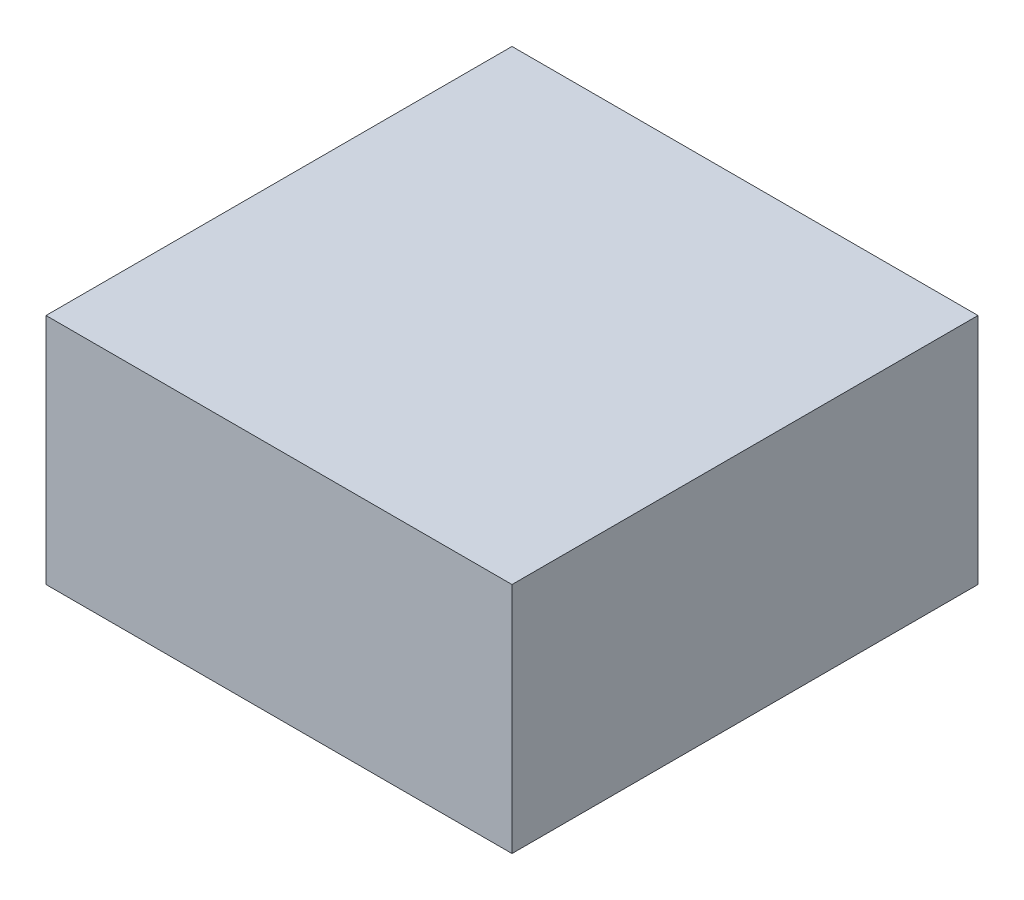
ISO-10303-21;
HEADER;
FILE_DESCRIPTION(('STEP AP214'),'2;1');
FILE_NAME('part.step','',(''),(''),'','','');
FILE_SCHEMA(('AUTOMOTIVE_DESIGN { 1 0 10303 214 1 1 1 1 }'));
ENDSEC;
DATA;
#1=APPLICATION_CONTEXT('core data for automotive mechanical design processes');
#2=APPLICATION_PROTOCOL_DEFINITION('international standard','automotive_design',2000,#1);
#3=PRODUCT_CONTEXT('',#1,'mechanical');
#4=PRODUCT('Part','Part','',(#3));
#5=PRODUCT_RELATED_PRODUCT_CATEGORY('part','',(#4));
#6=PRODUCT_DEFINITION_FORMATION('','',#4);
#7=PRODUCT_DEFINITION_CONTEXT('part definition',#1,'design');
#8=PRODUCT_DEFINITION('design','',#6,#7);
#9=PRODUCT_DEFINITION_SHAPE('','',#8);
#10=(LENGTH_UNIT() NAMED_UNIT(*) SI_UNIT(.MILLI.,.METRE.));
#11=(NAMED_UNIT(*) PLANE_ANGLE_UNIT() SI_UNIT($,.RADIAN.));
#12=(NAMED_UNIT(*) SI_UNIT($,.STERADIAN.) SOLID_ANGLE_UNIT());
#13=UNCERTAINTY_MEASURE_WITH_UNIT(LENGTH_MEASURE(1.E-05),#10,'distance_accuracy_value','');
#14=(GEOMETRIC_REPRESENTATION_CONTEXT(3) GLOBAL_UNCERTAINTY_ASSIGNED_CONTEXT((#13)) GLOBAL_UNIT_ASSIGNED_CONTEXT((#10,
#11,#12)) REPRESENTATION_CONTEXT('',''));
#15=CARTESIAN_POINT('',(0.,0.,0.));
#16=DIRECTION('',(0.,0.,1.));
#17=DIRECTION('',(1.,0.,0.));
#18=AXIS2_PLACEMENT_3D('',#15,#16,#17);
#19=CARTESIAN_POINT('',(-1.32978682457797,-4.7,12.0470966404881));
#20=CARTESIAN_POINT('',(-1.56949938233388,-4.7,12.2405123536894));
#21=CARTESIAN_POINT('',(-2.08614424851907,-4.7,12.5391697720833));
#22=CARTESIAN_POINT('',(-1.58643209411403,-4.7,13.1168891119311));
#23=CARTESIAN_POINT('',(-0.99479110722871,-4.7,13.4609601521511));
#24=CARTESIAN_POINT('',(-0.122057096544853,-4.7,13.5063472457396));
#25=CARTESIAN_POINT('',(0.780549472015395,-4.7,13.1044677868928));
#26=CARTESIAN_POINT('',(2.65290980881673,-4.7,13.5718372621998));
#27=CARTESIAN_POINT('',(1.37260667116618,-4.7,11.7465735610998));
#28=CARTESIAN_POINT('',(0.251281573482777,-4.7,11.3225744749199));
#29=CARTESIAN_POINT('',(-0.824147776626976,-4.7,11.5489578340658));
#30=CARTESIAN_POINT('',(-1.19634203116918,-4.7,11.9394246848268));
#31=CARTESIAN_POINT('',(-1.32978682457797,-4.7,12.0470966404881));
#32=B_SPLINE_CURVE_WITH_KNOTS('',3,(#19,#20,#21,#22,#23,#24,#25,#26,#27,#28,#29,#30,#31),
.UNSPECIFIED.,.T.,.F.,(4,1,1,1,1,1,1,1,1,1,4),(0.,0.0890314863366276,0.133435272323839,
0.204833870138696,0.315562123210451,0.38661889368764,0.538438655581061,0.696738525235763,
0.817182112999442,0.95043735542146,1.),.UNSPECIFIED.);
#33=DIRECTION('',(0.,-1.,0.));
#34=VECTOR('',#33,1.);
#35=SURFACE_OF_LINEAR_EXTRUSION('',#32,#34);
#36=CARTESIAN_POINT('',(-1.32978682457797,-4.7,12.0470966404881));
#37=VERTEX_POINT('',#36);
#38=EDGE_CURVE('E11',#37,#37,#32,.T.);
#39=ORIENTED_EDGE('',*,*,#38,.F.);
#40=EDGE_LOOP('',(#39));
#41=FACE_BOUND('',#40,.T.);
#42=CARTESIAN_POINT('',(-1.32978682457797,-5.,12.0470966404881));
#43=CARTESIAN_POINT('',(-1.56949938233388,-5.,12.2405123536894));
#44=CARTESIAN_POINT('',(-2.08614424851907,-5.,12.5391697720833));
#45=CARTESIAN_POINT('',(-1.58643209411403,-5.,13.1168891119311));
#46=CARTESIAN_POINT('',(-0.99479110722871,-5.,13.4609601521511));
#47=CARTESIAN_POINT('',(-0.122057096544853,-5.,13.5063472457396));
#48=CARTESIAN_POINT('',(0.780549472015395,-5.,13.1044677868928));
#49=CARTESIAN_POINT('',(2.65290980881673,-5.,13.5718372621998));
#50=CARTESIAN_POINT('',(1.37260667116618,-5.,11.7465735610998));
#51=CARTESIAN_POINT('',(0.251281573482777,-5.,11.3225744749199));
#52=CARTESIAN_POINT('',(-0.824147776626976,-5.,11.5489578340658));
#53=CARTESIAN_POINT('',(-1.19634203116918,-5.,11.9394246848268));
#54=CARTESIAN_POINT('',(-1.32978682457797,-5.,12.0470966404881));
#55=B_SPLINE_CURVE_WITH_KNOTS('',3,(#42,#43,#44,#45,#46,#47,#48,#49,#50,#51,#52,#53,#54),
.UNSPECIFIED.,.T.,.F.,(4,1,1,1,1,1,1,1,1,1,4),(0.,0.0890314863366276,0.133435272323839,
0.204833870138696,0.315562123210451,0.38661889368764,0.538438655581061,0.696738525235763,
0.817182112999442,0.95043735542146,1.),.UNSPECIFIED.);
#56=CARTESIAN_POINT('',(-1.32978682457797,-5.,12.0470966404881));
#57=VERTEX_POINT('',#56);
#58=EDGE_CURVE('E43',#57,#57,#55,.T.);
#59=ORIENTED_EDGE('',*,*,#58,.T.);
#60=EDGE_LOOP('',(#59));
#61=FACE_BOUND('',#60,.T.);
#62=ADVANCED_FACE('F39',(#41,#61),#35,.F.);
#63=CARTESIAN_POINT('',(1.81422588975815,-4.7,13.257386496687));
#64=DIRECTION('',(0.,-1.,0.));
#65=DIRECTION('',(0.,0.,-1.));
#66=AXIS2_PLACEMENT_3D('',#63,#64,#65);
#67=PLANE('',#66);
#68=ORIENTED_EDGE('',*,*,#38,.T.);
#69=EDGE_LOOP('',(#68));
#70=FACE_BOUND('',#69,.T.);
#71=ADVANCED_FACE('F62',(#70),#67,.F.);
#72=CARTESIAN_POINT('',(1.81422588975815,-5.,13.257386496687));
#73=DIRECTION('',(0.,-1.,0.));
#74=DIRECTION('',(0.,0.,-1.));
#75=AXIS2_PLACEMENT_3D('',#72,#73,#74);
#76=PLANE('',#75);
#77=ORIENTED_EDGE('',*,*,#58,.F.);
#78=EDGE_LOOP('',(#77));
#79=FACE_BOUND('',#78,.T.);
#80=ADVANCED_FACE('F60',(#79),#76,.T.);
#81=CLOSED_SHELL('',(#62,#71,#80));
#82=MANIFOLD_SOLID_BREP('B2',#81);
#83=CARTESIAN_POINT('',(7.5,4.,20.));
#84=DIRECTION('',(0.,0.,-1.));
#85=DIRECTION('',(-1.,0.,0.));
#86=AXIS2_PLACEMENT_3D('',#83,#84,#85);
#87=PLANE('',#86);
#88=CARTESIAN_POINT('',(7.5,4.,20.));
#89=DIRECTION('',(0.,0.,1.));
#90=DIRECTION('',(-1.,0.,0.));
#91=AXIS2_PLACEMENT_3D('',#88,#89,#90);
#92=CIRCLE('',#91,0.500000000000004);
#93=CARTESIAN_POINT('',(6.99999999999999,4.,20.));
#94=VERTEX_POINT('',#93);
#95=EDGE_CURVE('E108',#94,#94,#92,.T.);
#96=ORIENTED_EDGE('',*,*,#95,.T.);
#97=EDGE_LOOP('',(#96));
#98=FACE_BOUND('',#97,.T.);
#99=ADVANCED_FACE('F98',(#98),#87,.F.);
#100=CARTESIAN_POINT('',(7.5,5.,4.));
#101=DIRECTION('',(0.,1.,0.));
#102=DIRECTION('',(-1.,0.,0.));
#103=AXIS2_PLACEMENT_3D('',#100,#101,#102);
#104=PLANE('',#103);
#105=CARTESIAN_POINT('',(7.5,5.,4.));
#106=DIRECTION('',(0.,-1.,0.));
#107=DIRECTION('',(-1.,0.,0.));
#108=AXIS2_PLACEMENT_3D('',#105,#106,#107);
#109=CIRCLE('',#108,0.500000000000004);
#110=CARTESIAN_POINT('',(7.5,5.,3.5));
#111=VERTEX_POINT('',#110);
#112=EDGE_CURVE('E38',#111,#111,#109,.T.);
#113=ORIENTED_EDGE('',*,*,#112,.F.);
#114=EDGE_LOOP('',(#113));
#115=FACE_BOUND('',#114,.T.);
#116=ADVANCED_FACE('F119',(#115),#104,.T.);
#117=CARTESIAN_POINT('',(7.5,4.,20.));
#118=DIRECTION('',(0.,0.,-1.));
#119=DIRECTION('',(-1.,0.,0.));
#120=AXIS2_PLACEMENT_3D('',#117,#118,#119);
#121=CYLINDRICAL_SURFACE('',#120,0.500000000000004);
#122=CARTESIAN_POINT('',(7.5,4.,5.));
#123=DIRECTION('',(0.,0.,1.));
#124=DIRECTION('',(-1.,0.,0.));
#125=AXIS2_PLACEMENT_3D('',#122,#123,#124);
#126=CIRCLE('',#125,0.500000000000004);
#127=CARTESIAN_POINT('',(7.5,3.5,5.));
#128=VERTEX_POINT('',#127);
#129=EDGE_CURVE('E104',#128,#128,#126,.T.);
#130=ORIENTED_EDGE('',*,*,#129,.T.);
#131=EDGE_LOOP('',(#130));
#132=FACE_BOUND('',#131,.T.);
#133=ORIENTED_EDGE('',*,*,#95,.F.);
#134=EDGE_LOOP('',(#133));
#135=FACE_BOUND('',#134,.T.);
#136=ADVANCED_FACE('F116',(#132,#135),#121,.T.);
#137=CARTESIAN_POINT('',(7.5,5.,5.));
#138=DIRECTION('',(1.,0.,0.));
#139=DIRECTION('',(0.,0.,-1.));
#140=AXIS2_PLACEMENT_3D('',#137,#138,#139);
#141=TOROIDAL_SURFACE('',#140,0.999999999999998,0.500000000000004);
#142=CARTESIAN_POINT('',(7.5,5.,5.));
#143=DIRECTION('',(1.,0.,0.));
#144=DIRECTION('',(0.,0.,-1.));
#145=AXIS2_PLACEMENT_3D('',#142,#143,#144);
#146=CIRCLE('',#145,1.5);
#147=EDGE_CURVE('',#128,#111,#146,.T.);
#148=ORIENTED_EDGE('',*,*,#129,.F.);
#149=ORIENTED_EDGE('',*,*,#112,.T.);
#150=ORIENTED_EDGE('',*,*,#147,.T.);
#151=ORIENTED_EDGE('',*,*,#147,.F.);
#152=EDGE_LOOP('',(#148,#150,#149,#151));
#153=FACE_BOUND('',#152,.T.);
#154=ADVANCED_FACE('F118',(#153),#141,.T.);
#155=CLOSED_SHELL('',(#99,#116,#136,#154));
#156=MANIFOLD_SOLID_BREP('B6',#155);
#157=CARTESIAN_POINT('',(-7.5,4.,20.));
#158=DIRECTION('',(0.,0.,1.));
#159=DIRECTION('',(1.,0.,0.));
#160=AXIS2_PLACEMENT_3D('',#157,#158,#159);
#161=PLANE('',#160);
#162=CARTESIAN_POINT('',(-7.5,4.,20.));
#163=DIRECTION('',(0.,0.,1.));
#164=DIRECTION('',(1.,0.,0.));
#165=AXIS2_PLACEMENT_3D('',#162,#163,#164);
#166=CIRCLE('',#165,0.500000000000002);
#167=CARTESIAN_POINT('',(-7.,4.,20.));
#168=VERTEX_POINT('',#167);
#169=EDGE_CURVE('E172',#168,#168,#166,.T.);
#170=ORIENTED_EDGE('',*,*,#169,.T.);
#171=EDGE_LOOP('',(#170));
#172=FACE_BOUND('',#171,.T.);
#173=ADVANCED_FACE('F162',(#172),#161,.T.);
#174=CARTESIAN_POINT('',(-7.5,5.,4.));
#175=DIRECTION('',(0.,-1.,0.));
#176=DIRECTION('',(1.,0.,0.));
#177=AXIS2_PLACEMENT_3D('',#174,#175,#176);
#178=PLANE('',#177);
#179=CARTESIAN_POINT('',(-7.5,5.,4.));
#180=DIRECTION('',(0.,-1.,0.));
#181=DIRECTION('',(1.,0.,0.));
#182=AXIS2_PLACEMENT_3D('',#179,#180,#181);
#183=CIRCLE('',#182,0.500000000000002);
#184=CARTESIAN_POINT('',(-7.5,5.,3.5));
#185=VERTEX_POINT('',#184);
#186=EDGE_CURVE('E97',#185,#185,#183,.T.);
#187=ORIENTED_EDGE('',*,*,#186,.F.);
#188=EDGE_LOOP('',(#187));
#189=FACE_BOUND('',#188,.T.);
#190=ADVANCED_FACE('F183',(#189),#178,.F.);
#191=CARTESIAN_POINT('',(-7.5,4.,20.));
#192=DIRECTION('',(0.,0.,-1.));
#193=DIRECTION('',(-1.,0.,0.));
#194=AXIS2_PLACEMENT_3D('',#191,#192,#193);
#195=CYLINDRICAL_SURFACE('',#194,0.500000000000002);
#196=CARTESIAN_POINT('',(-7.5,4.,5.));
#197=DIRECTION('',(0.,0.,1.));
#198=DIRECTION('',(1.,0.,0.));
#199=AXIS2_PLACEMENT_3D('',#196,#197,#198);
#200=CIRCLE('',#199,0.500000000000002);
#201=CARTESIAN_POINT('',(-7.5,3.5,5.));
#202=VERTEX_POINT('',#201);
#203=EDGE_CURVE('E168',#202,#202,#200,.T.);
#204=ORIENTED_EDGE('',*,*,#203,.T.);
#205=EDGE_LOOP('',(#204));
#206=FACE_BOUND('',#205,.T.);
#207=ORIENTED_EDGE('',*,*,#169,.F.);
#208=EDGE_LOOP('',(#207));
#209=FACE_BOUND('',#208,.T.);
#210=ADVANCED_FACE('F180',(#206,#209),#195,.T.);
#211=CARTESIAN_POINT('',(-7.5,5.,5.));
#212=DIRECTION('',(1.,0.,0.));
#213=DIRECTION('',(0.,0.,-1.));
#214=AXIS2_PLACEMENT_3D('',#211,#212,#213);
#215=TOROIDAL_SURFACE('',#214,1.,0.500000000000002);
#216=CARTESIAN_POINT('',(-7.5,5.,5.));
#217=DIRECTION('',(1.,0.,0.));
#218=DIRECTION('',(0.,0.,-1.));
#219=AXIS2_PLACEMENT_3D('',#216,#217,#218);
#220=CIRCLE('',#219,1.5);
#221=EDGE_CURVE('',#202,#185,#220,.T.);
#222=ORIENTED_EDGE('',*,*,#203,.F.);
#223=ORIENTED_EDGE('',*,*,#186,.T.);
#224=ORIENTED_EDGE('',*,*,#221,.T.);
#225=ORIENTED_EDGE('',*,*,#221,.F.);
#226=EDGE_LOOP('',(#222,#224,#223,#225));
#227=FACE_BOUND('',#226,.T.);
#228=ADVANCED_FACE('F182',(#227),#215,.T.);
#229=CLOSED_SHELL('',(#173,#190,#210,#228));
#230=MANIFOLD_SOLID_BREP('B33',#229);
#231=CARTESIAN_POINT('',(10.,-5.,20.));
#232=DIRECTION('',(-1.,0.,0.));
#233=DIRECTION('',(0.,0.,1.));
#234=AXIS2_PLACEMENT_3D('',#231,#232,#233);
#235=PLANE('',#234);
#236=DIRECTION('',(0.,1.,0.));
#237=VECTOR('',#236,1.);
#238=CARTESIAN_POINT('',(10.,-5.,0.));
#239=LINE('',#238,#237);
#240=CARTESIAN_POINT('',(10.,-5.,0.));
#241=VERTEX_POINT('',#240);
#242=CARTESIAN_POINT('',(10.,5.,0.));
#243=VERTEX_POINT('',#242);
#244=EDGE_CURVE('E280',#241,#243,#239,.T.);
#245=ORIENTED_EDGE('',*,*,#244,.T.);
#246=DIRECTION('',(0.,0.,-1.));
#247=VECTOR('',#246,1.);
#248=CARTESIAN_POINT('',(10.,5.,20.));
#249=LINE('',#248,#247);
#250=CARTESIAN_POINT('',(10.,5.,20.));
#251=VERTEX_POINT('',#250);
#252=EDGE_CURVE('E160',#251,#243,#249,.T.);
#253=ORIENTED_EDGE('',*,*,#252,.F.);
#254=DIRECTION('',(0.,1.,0.));
#255=VECTOR('',#254,1.);
#256=CARTESIAN_POINT('',(10.,-5.,20.));
#257=LINE('',#256,#255);
#258=CARTESIAN_POINT('',(10.,-5.,20.));
#259=VERTEX_POINT('',#258);
#260=EDGE_CURVE('E268',#259,#251,#257,.T.);
#261=ORIENTED_EDGE('',*,*,#260,.F.);
#262=DIRECTION('',(0.,0.,-1.));
#263=VECTOR('',#262,1.);
#264=CARTESIAN_POINT('',(10.,-5.,20.));
#265=LINE('',#264,#263);
#266=EDGE_CURVE('E276',#259,#241,#265,.T.);
#267=ORIENTED_EDGE('',*,*,#266,.T.);
#268=EDGE_LOOP('',(#245,#253,#261,#267));
#269=FACE_BOUND('',#268,.T.);
#270=ADVANCED_FACE('F217',(#269),#235,.F.);
#271=CARTESIAN_POINT('',(-10.,5.,20.));
#272=DIRECTION('',(0.,-1.,0.));
#273=DIRECTION('',(0.,0.,-1.));
#274=AXIS2_PLACEMENT_3D('',#271,#272,#273);
#275=PLANE('',#274);
#276=DIRECTION('',(-1.,0.,0.));
#277=VECTOR('',#276,1.);
#278=CARTESIAN_POINT('',(-10.,5.,0.));
#279=LINE('',#278,#277);
#280=CARTESIAN_POINT('',(-10.,5.,0.));
#281=VERTEX_POINT('',#280);
#282=EDGE_CURVE('E272',#243,#281,#279,.T.);
#283=ORIENTED_EDGE('',*,*,#282,.T.);
#284=DIRECTION('',(0.,0.,-1.));
#285=VECTOR('',#284,1.);
#286=CARTESIAN_POINT('',(-10.,5.,20.));
#287=LINE('',#286,#285);
#288=CARTESIAN_POINT('',(-10.,5.,20.));
#289=VERTEX_POINT('',#288);
#290=EDGE_CURVE('E225',#289,#281,#287,.T.);
#291=ORIENTED_EDGE('',*,*,#290,.F.);
#292=DIRECTION('',(-1.,0.,0.));
#293=VECTOR('',#292,1.);
#294=CARTESIAN_POINT('',(-10.,5.,20.));
#295=LINE('',#294,#293);
#296=EDGE_CURVE('E263',#251,#289,#295,.T.);
#297=ORIENTED_EDGE('',*,*,#296,.F.);
#298=ORIENTED_EDGE('',*,*,#252,.T.);
#299=EDGE_LOOP('',(#283,#291,#297,#298));
#300=FACE_BOUND('',#299,.T.);
#301=ADVANCED_FACE('F271',(#300),#275,.F.);
#302=CARTESIAN_POINT('',(-10.,-5.,20.));
#303=DIRECTION('',(1.,0.,0.));
#304=DIRECTION('',(0.,1.,0.));
#305=AXIS2_PLACEMENT_3D('',#302,#303,#304);
#306=PLANE('',#305);
#307=DIRECTION('',(0.,-1.,0.));
#308=VECTOR('',#307,1.);
#309=CARTESIAN_POINT('',(-10.,-5.,0.));
#310=LINE('',#309,#308);
#311=CARTESIAN_POINT('',(-10.,-5.,0.));
#312=VERTEX_POINT('',#311);
#313=EDGE_CURVE('E250',#281,#312,#310,.T.);
#314=ORIENTED_EDGE('',*,*,#313,.T.);
#315=DIRECTION('',(0.,0.,-1.));
#316=VECTOR('',#315,1.);
#317=CARTESIAN_POINT('',(-10.,-5.,20.));
#318=LINE('',#317,#316);
#319=CARTESIAN_POINT('',(-10.,-5.,20.));
#320=VERTEX_POINT('',#319);
#321=EDGE_CURVE('E273',#320,#312,#318,.T.);
#322=ORIENTED_EDGE('',*,*,#321,.F.);
#323=DIRECTION('',(0.,-1.,0.));
#324=VECTOR('',#323,1.);
#325=CARTESIAN_POINT('',(-10.,-5.,20.));
#326=LINE('',#325,#324);
#327=EDGE_CURVE('E266',#289,#320,#326,.T.);
#328=ORIENTED_EDGE('',*,*,#327,.F.);
#329=ORIENTED_EDGE('',*,*,#290,.T.);
#330=EDGE_LOOP('',(#314,#322,#328,#329));
#331=FACE_BOUND('',#330,.T.);
#332=ADVANCED_FACE('F274',(#331),#306,.F.);
#333=CARTESIAN_POINT('',(-10.,-5.,20.));
#334=DIRECTION('',(0.,1.,0.));
#335=DIRECTION('',(0.,0.,1.));
#336=AXIS2_PLACEMENT_3D('',#333,#334,#335);
#337=PLANE('',#336);
#338=DIRECTION('',(1.,0.,0.));
#339=VECTOR('',#338,1.);
#340=CARTESIAN_POINT('',(-10.,-5.,0.));
#341=LINE('',#340,#339);
#342=EDGE_CURVE('E256',#312,#241,#341,.T.);
#343=ORIENTED_EDGE('',*,*,#342,.T.);
#344=ORIENTED_EDGE('',*,*,#266,.F.);
#345=DIRECTION('',(1.,0.,0.));
#346=VECTOR('',#345,1.);
#347=CARTESIAN_POINT('',(-10.,-5.,20.));
#348=LINE('',#347,#346);
#349=EDGE_CURVE('E233',#320,#259,#348,.T.);
#350=ORIENTED_EDGE('',*,*,#349,.F.);
#351=ORIENTED_EDGE('',*,*,#321,.T.);
#352=EDGE_LOOP('',(#343,#344,#350,#351));
#353=FACE_BOUND('',#352,.T.);
#354=ADVANCED_FACE('F287',(#353),#337,.F.);
#355=CARTESIAN_POINT('',(0.,0.,20.));
#356=DIRECTION('',(0.,0.,-1.));
#357=DIRECTION('',(-1.,0.,0.));
#358=AXIS2_PLACEMENT_3D('',#355,#356,#357);
#359=PLANE('',#358);
#360=ORIENTED_EDGE('',*,*,#260,.T.);
#361=ORIENTED_EDGE('',*,*,#296,.T.);
#362=ORIENTED_EDGE('',*,*,#327,.T.);
#363=ORIENTED_EDGE('',*,*,#349,.T.);
#364=EDGE_LOOP('',(#360,#361,#362,#363));
#365=FACE_BOUND('',#364,.T.);
#366=ADVANCED_FACE('F264',(#365),#359,.F.);
#367=CARTESIAN_POINT('',(0.,0.,0.));
#368=DIRECTION('',(0.,0.,-1.));
#369=DIRECTION('',(-1.,0.,0.));
#370=AXIS2_PLACEMENT_3D('',#367,#368,#369);
#371=PLANE('',#370);
#372=ORIENTED_EDGE('',*,*,#244,.F.);
#373=ORIENTED_EDGE('',*,*,#342,.F.);
#374=ORIENTED_EDGE('',*,*,#313,.F.);
#375=ORIENTED_EDGE('',*,*,#282,.F.);
#376=EDGE_LOOP('',(#372,#373,#374,#375));
#377=FACE_BOUND('',#376,.T.);
#378=ADVANCED_FACE('F290',(#377),#371,.T.);
#379=CLOSED_SHELL('',(#270,#301,#332,#354,#366,#378));
#380=MANIFOLD_SOLID_BREP('B92',#379);
#381=ADVANCED_BREP_SHAPE_REPRESENTATION('',(#18,#82,#156,#230,#380),#14);
#382=SHAPE_DEFINITION_REPRESENTATION(#9,#381);
ENDSEC;
END-ISO-10303-21;
